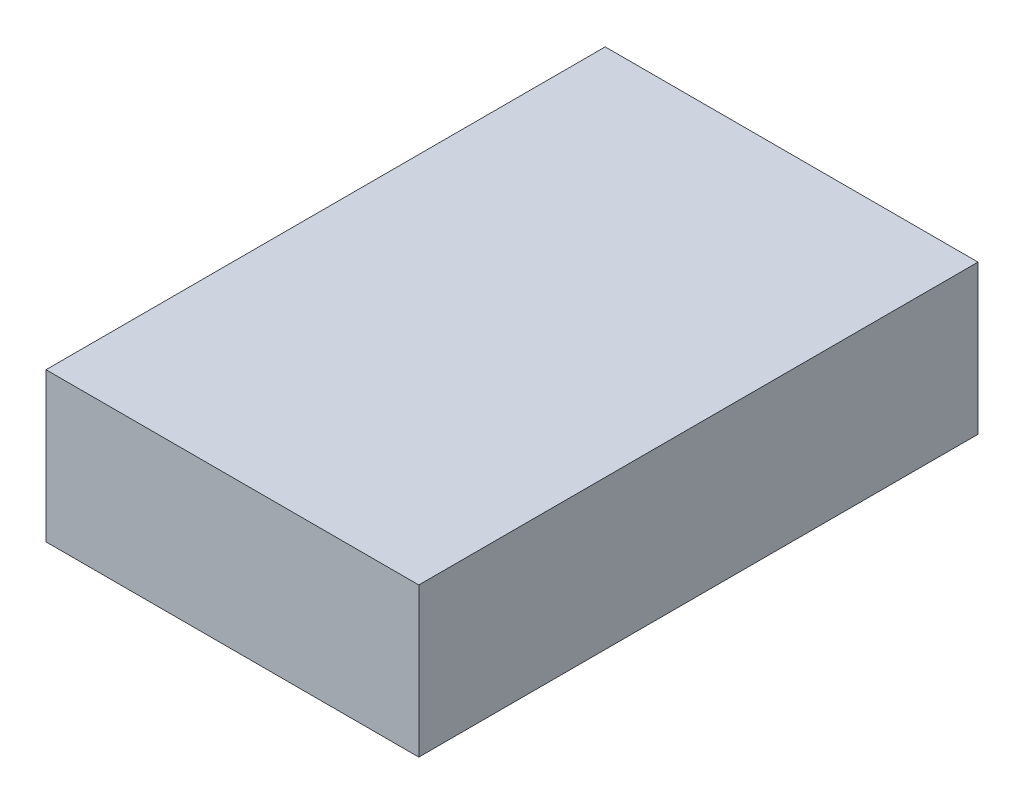
ISO-10303-21;
HEADER;
FILE_DESCRIPTION(('STEP AP214'),'2;1');
FILE_NAME('part.step','',(''),(''),'','','');
FILE_SCHEMA(('AUTOMOTIVE_DESIGN { 1 0 10303 214 1 1 1 1 }'));
ENDSEC;
DATA;
#1=APPLICATION_CONTEXT('core data for automotive mechanical design processes');
#2=APPLICATION_PROTOCOL_DEFINITION('international standard','automotive_design',2000,#1);
#3=PRODUCT_CONTEXT('',#1,'mechanical');
#4=PRODUCT('Part','Part','',(#3));
#5=PRODUCT_RELATED_PRODUCT_CATEGORY('part','',(#4));
#6=PRODUCT_DEFINITION_FORMATION('','',#4);
#7=PRODUCT_DEFINITION_CONTEXT('part definition',#1,'design');
#8=PRODUCT_DEFINITION('design','',#6,#7);
#9=PRODUCT_DEFINITION_SHAPE('','',#8);
#10=(LENGTH_UNIT() NAMED_UNIT(*) SI_UNIT(.MILLI.,.METRE.));
#11=(NAMED_UNIT(*) PLANE_ANGLE_UNIT() SI_UNIT($,.RADIAN.));
#12=(NAMED_UNIT(*) SI_UNIT($,.STERADIAN.) SOLID_ANGLE_UNIT());
#13=UNCERTAINTY_MEASURE_WITH_UNIT(LENGTH_MEASURE(1.E-05),#10,'distance_accuracy_value','');
#14=(GEOMETRIC_REPRESENTATION_CONTEXT(3) GLOBAL_UNCERTAINTY_ASSIGNED_CONTEXT((#13)) GLOBAL_UNIT_ASSIGNED_CONTEXT((#10,
#11,#12)) REPRESENTATION_CONTEXT('',''));
#15=CARTESIAN_POINT('',(0.,0.,0.));
#16=DIRECTION('',(0.,0.,1.));
#17=DIRECTION('',(1.,0.,0.));
#18=AXIS2_PLACEMENT_3D('',#15,#16,#17);
#19=CARTESIAN_POINT('',(1.,0.8,-1.5));
#20=DIRECTION('',(-1.,0.,0.));
#21=DIRECTION('',(0.,0.,1.));
#22=AXIS2_PLACEMENT_3D('',#19,#20,#21);
#23=PLANE('',#22);
#24=DIRECTION('',(0.,0.,-1.));
#25=VECTOR('',#24,1.);
#26=CARTESIAN_POINT('',(1.,0.,-1.5));
#27=LINE('',#26,#25);
#28=CARTESIAN_POINT('',(1.,0.,1.5));
#29=VERTEX_POINT('',#28);
#30=CARTESIAN_POINT('',(1.,0.,-1.5));
#31=VERTEX_POINT('',#30);
#32=EDGE_CURVE('E98',#29,#31,#27,.T.);
#33=ORIENTED_EDGE('',*,*,#32,.T.);
#34=DIRECTION('',(0.,-1.,0.));
#35=VECTOR('',#34,1.);
#36=CARTESIAN_POINT('',(1.,0.8,-1.5));
#37=LINE('',#36,#35);
#38=CARTESIAN_POINT('',(1.,0.8,-1.5));
#39=VERTEX_POINT('',#38);
#40=EDGE_CURVE('E11',#39,#31,#37,.T.);
#41=ORIENTED_EDGE('',*,*,#40,.F.);
#42=DIRECTION('',(0.,0.,-1.));
#43=VECTOR('',#42,1.);
#44=CARTESIAN_POINT('',(1.,0.8,-1.5));
#45=LINE('',#44,#43);
#46=CARTESIAN_POINT('',(1.,0.8,1.5));
#47=VERTEX_POINT('',#46);
#48=EDGE_CURVE('E86',#47,#39,#45,.T.);
#49=ORIENTED_EDGE('',*,*,#48,.F.);
#50=DIRECTION('',(0.,-1.,0.));
#51=VECTOR('',#50,1.);
#52=CARTESIAN_POINT('',(1.,0.8,1.5));
#53=LINE('',#52,#51);
#54=EDGE_CURVE('E94',#47,#29,#53,.T.);
#55=ORIENTED_EDGE('',*,*,#54,.T.);
#56=EDGE_LOOP('',(#33,#41,#49,#55));
#57=FACE_BOUND('',#56,.T.);
#58=ADVANCED_FACE('F35',(#57),#23,.F.);
#59=CARTESIAN_POINT('',(-1.,0.8,-1.5));
#60=DIRECTION('',(0.,0.,1.));
#61=DIRECTION('',(1.,0.,0.));
#62=AXIS2_PLACEMENT_3D('',#59,#60,#61);
#63=PLANE('',#62);
#64=DIRECTION('',(-1.,0.,0.));
#65=VECTOR('',#64,1.);
#66=CARTESIAN_POINT('',(-1.,0.,-1.5));
#67=LINE('',#66,#65);
#68=CARTESIAN_POINT('',(-1.,0.,-1.5));
#69=VERTEX_POINT('',#68);
#70=EDGE_CURVE('E90',#31,#69,#67,.T.);
#71=ORIENTED_EDGE('',*,*,#70,.T.);
#72=DIRECTION('',(0.,-1.,0.));
#73=VECTOR('',#72,1.);
#74=CARTESIAN_POINT('',(-1.,0.8,-1.5));
#75=LINE('',#74,#73);
#76=CARTESIAN_POINT('',(-1.,0.8,-1.5));
#77=VERTEX_POINT('',#76);
#78=EDGE_CURVE('E43',#77,#69,#75,.T.);
#79=ORIENTED_EDGE('',*,*,#78,.F.);
#80=DIRECTION('',(-1.,0.,0.));
#81=VECTOR('',#80,1.);
#82=CARTESIAN_POINT('',(-1.,0.8,-1.5));
#83=LINE('',#82,#81);
#84=EDGE_CURVE('E81',#39,#77,#83,.T.);
#85=ORIENTED_EDGE('',*,*,#84,.F.);
#86=ORIENTED_EDGE('',*,*,#40,.T.);
#87=EDGE_LOOP('',(#71,#79,#85,#86));
#88=FACE_BOUND('',#87,.T.);
#89=ADVANCED_FACE('F89',(#88),#63,.F.);
#90=CARTESIAN_POINT('',(-1.,0.8,-1.5));
#91=DIRECTION('',(1.,0.,0.));
#92=DIRECTION('',(0.,0.,-1.));
#93=AXIS2_PLACEMENT_3D('',#90,#91,#92);
#94=PLANE('',#93);
#95=DIRECTION('',(0.,0.,1.));
#96=VECTOR('',#95,1.);
#97=CARTESIAN_POINT('',(-1.,0.,-1.5));
#98=LINE('',#97,#96);
#99=CARTESIAN_POINT('',(-0.999999999999999,0.,1.5));
#100=VERTEX_POINT('',#99);
#101=EDGE_CURVE('E68',#69,#100,#98,.T.);
#102=ORIENTED_EDGE('',*,*,#101,.T.);
#103=DIRECTION('',(0.,-1.,0.));
#104=VECTOR('',#103,1.);
#105=CARTESIAN_POINT('',(-0.999999999999999,0.8,1.5));
#106=LINE('',#105,#104);
#107=CARTESIAN_POINT('',(-0.999999999999999,0.8,1.5));
#108=VERTEX_POINT('',#107);
#109=EDGE_CURVE('E91',#108,#100,#106,.T.);
#110=ORIENTED_EDGE('',*,*,#109,.F.);
#111=DIRECTION('',(0.,0.,1.));
#112=VECTOR('',#111,1.);
#113=CARTESIAN_POINT('',(-1.,0.8,-1.5));
#114=LINE('',#113,#112);
#115=EDGE_CURVE('E84',#77,#108,#114,.T.);
#116=ORIENTED_EDGE('',*,*,#115,.F.);
#117=ORIENTED_EDGE('',*,*,#78,.T.);
#118=EDGE_LOOP('',(#102,#110,#116,#117));
#119=FACE_BOUND('',#118,.T.);
#120=ADVANCED_FACE('F92',(#119),#94,.F.);
#121=CARTESIAN_POINT('',(-0.999999999999999,0.8,1.5));
#122=DIRECTION('',(0.,0.,-1.));
#123=DIRECTION('',(-1.,0.,0.));
#124=AXIS2_PLACEMENT_3D('',#121,#122,#123);
#125=PLANE('',#124);
#126=DIRECTION('',(1.,0.,0.));
#127=VECTOR('',#126,1.);
#128=CARTESIAN_POINT('',(-0.999999999999999,0.,1.5));
#129=LINE('',#128,#127);
#130=EDGE_CURVE('E74',#100,#29,#129,.T.);
#131=ORIENTED_EDGE('',*,*,#130,.T.);
#132=ORIENTED_EDGE('',*,*,#54,.F.);
#133=DIRECTION('',(1.,0.,0.));
#134=VECTOR('',#133,1.);
#135=CARTESIAN_POINT('',(-0.999999999999999,0.8,1.5));
#136=LINE('',#135,#134);
#137=EDGE_CURVE('E51',#108,#47,#136,.T.);
#138=ORIENTED_EDGE('',*,*,#137,.F.);
#139=ORIENTED_EDGE('',*,*,#109,.T.);
#140=EDGE_LOOP('',(#131,#132,#138,#139));
#141=FACE_BOUND('',#140,.T.);
#142=ADVANCED_FACE('F105',(#141),#125,.F.);
#143=CARTESIAN_POINT('',(0.,0.8,0.));
#144=DIRECTION('',(0.,1.,0.));
#145=DIRECTION('',(0.,0.,1.));
#146=AXIS2_PLACEMENT_3D('',#143,#144,#145);
#147=PLANE('',#146);
#148=ORIENTED_EDGE('',*,*,#48,.T.);
#149=ORIENTED_EDGE('',*,*,#84,.T.);
#150=ORIENTED_EDGE('',*,*,#115,.T.);
#151=ORIENTED_EDGE('',*,*,#137,.T.);
#152=EDGE_LOOP('',(#148,#149,#150,#151));
#153=FACE_BOUND('',#152,.T.);
#154=ADVANCED_FACE('F82',(#153),#147,.T.);
#155=CARTESIAN_POINT('',(0.,0.,0.));
#156=DIRECTION('',(0.,1.,0.));
#157=DIRECTION('',(0.,0.,1.));
#158=AXIS2_PLACEMENT_3D('',#155,#156,#157);
#159=PLANE('',#158);
#160=ORIENTED_EDGE('',*,*,#32,.F.);
#161=ORIENTED_EDGE('',*,*,#130,.F.);
#162=ORIENTED_EDGE('',*,*,#101,.F.);
#163=ORIENTED_EDGE('',*,*,#70,.F.);
#164=EDGE_LOOP('',(#160,#161,#162,#163));
#165=FACE_BOUND('',#164,.T.);
#166=ADVANCED_FACE('F108',(#165),#159,.F.);
#167=CLOSED_SHELL('',(#58,#89,#120,#142,#154,#166));
#168=MANIFOLD_SOLID_BREP('B2',#167);
#169=ADVANCED_BREP_SHAPE_REPRESENTATION('',(#18,#168),#14);
#170=SHAPE_DEFINITION_REPRESENTATION(#9,#169);
ENDSEC;
END-ISO-10303-21;
